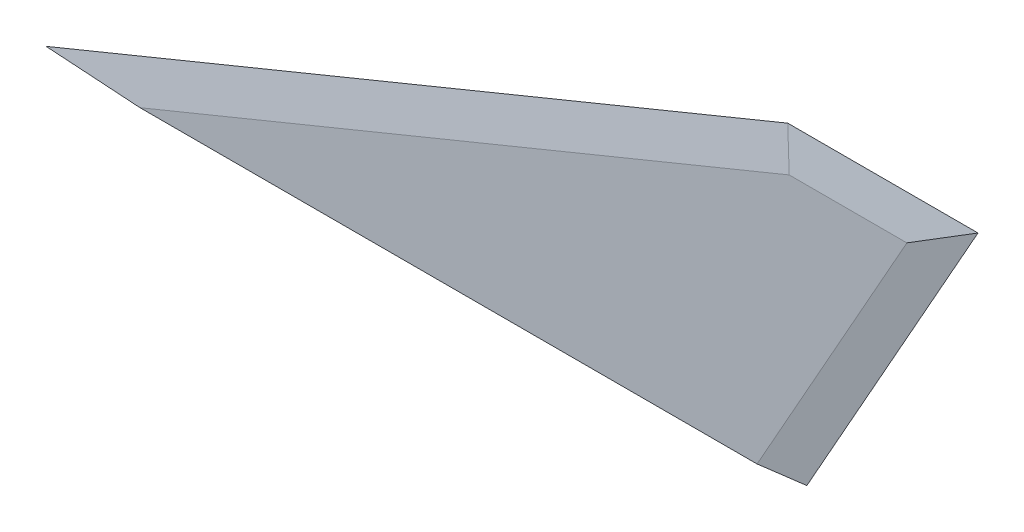
ISO-10303-21;
HEADER;
FILE_DESCRIPTION(('STEP AP214'),'2;1');
FILE_NAME('part.step','',(''),(''),'','','');
FILE_SCHEMA(('AUTOMOTIVE_DESIGN { 1 0 10303 214 1 1 1 1 }'));
ENDSEC;
DATA;
#1=APPLICATION_CONTEXT('core data for automotive mechanical design processes');
#2=APPLICATION_PROTOCOL_DEFINITION('international standard','automotive_design',2000,#1);
#3=PRODUCT_CONTEXT('',#1,'mechanical');
#4=PRODUCT('Part','Part','',(#3));
#5=PRODUCT_RELATED_PRODUCT_CATEGORY('part','',(#4));
#6=PRODUCT_DEFINITION_FORMATION('','',#4);
#7=PRODUCT_DEFINITION_CONTEXT('part definition',#1,'design');
#8=PRODUCT_DEFINITION('design','',#6,#7);
#9=PRODUCT_DEFINITION_SHAPE('','',#8);
#10=(LENGTH_UNIT() NAMED_UNIT(*) SI_UNIT(.MILLI.,.METRE.));
#11=(NAMED_UNIT(*) PLANE_ANGLE_UNIT() SI_UNIT($,.RADIAN.));
#12=(NAMED_UNIT(*) SI_UNIT($,.STERADIAN.) SOLID_ANGLE_UNIT());
#13=UNCERTAINTY_MEASURE_WITH_UNIT(LENGTH_MEASURE(1.E-05),#10,'distance_accuracy_value','');
#14=(GEOMETRIC_REPRESENTATION_CONTEXT(3) GLOBAL_UNCERTAINTY_ASSIGNED_CONTEXT((#13)) GLOBAL_UNIT_ASSIGNED_CONTEXT((#10,
#11,#12)) REPRESENTATION_CONTEXT('',''));
#15=CARTESIAN_POINT('',(0.,0.,0.));
#16=DIRECTION('',(0.,0.,1.));
#17=DIRECTION('',(1.,0.,0.));
#18=AXIS2_PLACEMENT_3D('',#15,#16,#17);
#19=CARTESIAN_POINT('',(143.221894277,-80.5522465000001,3.18));
#20=DIRECTION('',(-0.136865424260641,0.0769771789992358,-0.987594233253351));
#21=DIRECTION('',(0.490214690357422,0.871601719455496,0.));
#22=AXIS2_PLACEMENT_3D('',#19,#20,#21);
#23=PLANE('',#22);
#24=DIRECTION('',(0.490214690357422,0.871601719455496,0.));
#25=VECTOR('',#24,1.);
#26=CARTESIAN_POINT('',(143.221894277,-80.5522465000001,3.18));
#27=LINE('',#26,#25);
#28=CARTESIAN_POINT('',(188.526869811309,0.,3.18));
#29=VERTEX_POINT('',#28);
#30=CARTESIAN_POINT('',(227.902572848429,70.0099999999997,3.18));
#31=VERTEX_POINT('',#30);
#32=EDGE_CURVE('E125',#29,#31,#27,.T.);
#33=ORIENTED_EDGE('',*,*,#32,.F.);
#34=CARTESIAN_POINT('',(176.957728958506,-40.9691579117755,1.59));
#35=DIRECTION('',(-0.136865424260641,0.0769771789992358,-0.987594233253351));
#36=DIRECTION('',(-0.990589650481951,-0.010635598965719,0.136451560609198));
#37=AXIS2_PLACEMENT_3D('',#34,#35,#36);
#38=ELLIPSE('',#37,299.564336438406,41.);
#39=CARTESIAN_POINT('',(200.,0.0308420177488819,1.59240395441873));
#40=VERTEX_POINT('',#39);
#41=EDGE_CURVE('E119',#29,#40,#38,.T.);
#42=ORIENTED_EDGE('',*,*,#41,.T.);
#43=DIRECTION('',(0.,-0.996976127070232,-0.0777084426046488));
#44=VECTOR('',#43,1.);
#45=CARTESIAN_POINT('',(200.,-79.9426407341724,-4.64106004294312));
#46=LINE('',#45,#44);
#47=CARTESIAN_POINT('',(200.,0.,1.59));
#48=VERTEX_POINT('',#47);
#49=EDGE_CURVE('E107',#48,#40,#46,.F.);
#50=ORIENTED_EDGE('',*,*,#49,.F.);
#51=DIRECTION('',(-0.490214690357422,-0.871601719455496,0.));
#52=VECTOR('',#51,1.);
#53=CARTESIAN_POINT('',(200.,0.,1.58999999999999));
#54=LINE('',#53,#52);
#55=CARTESIAN_POINT('',(245.,80.01,1.58999999999999));
#56=VERTEX_POINT('',#55);
#57=EDGE_CURVE('E154',#56,#48,#54,.T.);
#58=ORIENTED_EDGE('',*,*,#57,.F.);
#59=DIRECTION('',(0.860428183681422,0.503250094914057,-0.0800167650913335));
#60=VECTOR('',#59,1.);
#61=CARTESIAN_POINT('',(59.1779434260307,-28.6742218578463,18.8707912753972));
#62=LINE('',#61,#60);
#63=EDGE_CURVE('E165',#56,#31,#62,.F.);
#64=ORIENTED_EDGE('',*,*,#63,.T.);
#65=EDGE_LOOP('',(#33,#42,#50,#58,#64));
#66=FACE_BOUND('',#65,.T.);
#67=ADVANCED_FACE('F47',(#66),#23,.F.);
#68=CARTESIAN_POINT('',(200.,0.,1.59));
#69=DIRECTION('',(0.136865424260642,-0.076977178999236,-0.987594233253351));
#70=DIRECTION('',(-0.490214690357422,-0.871601719455496,0.));
#71=AXIS2_PLACEMENT_3D('',#68,#69,#70);
#72=PLANE('',#71);
#73=DIRECTION('',(0.,-0.996976127070232,0.0777084426046489));
#74=VECTOR('',#73,1.);
#75=CARTESIAN_POINT('',(200.,0.,1.59));
#76=LINE('',#75,#74);
#77=CARTESIAN_POINT('',(200.,0.0308420882244587,1.5875960400881));
#78=VERTEX_POINT('',#77);
#79=EDGE_CURVE('E57',#78,#48,#76,.T.);
#80=ORIENTED_EDGE('',*,*,#79,.F.);
#81=CARTESIAN_POINT('',(176.957728958506,-40.9691579117755,1.59));
#82=DIRECTION('',(0.136865424260642,-0.076977178999236,-0.987594233253351));
#83=DIRECTION('',(-0.990589650481951,-0.010635598965719,-0.136451560609199));
#84=AXIS2_PLACEMENT_3D('',#81,#82,#83);
#85=ELLIPSE('',#84,299.564336438406,41.);
#86=CARTESIAN_POINT('',(188.526869811309,0.,0.));
#87=VERTEX_POINT('',#86);
#88=EDGE_CURVE('E11',#78,#87,#85,.F.);
#89=ORIENTED_EDGE('',*,*,#88,.T.);
#90=DIRECTION('',(-0.490214690357422,-0.871601719455496,0.));
#91=VECTOR('',#90,1.);
#92=CARTESIAN_POINT('',(191.283982805445,4.90214690357433,0.));
#93=LINE('',#92,#91);
#94=CARTESIAN_POINT('',(227.902572848429,70.0099999999998,0.));
#95=VERTEX_POINT('',#94);
#96=EDGE_CURVE('E175',#95,#87,#93,.T.);
#97=ORIENTED_EDGE('',*,*,#96,.F.);
#98=DIRECTION('',(-0.860428183681422,-0.503250094914057,-0.0800167650913336));
#99=VECTOR('',#98,1.);
#100=CARTESIAN_POINT('',(245.,80.01,1.59));
#101=LINE('',#100,#99);
#102=EDGE_CURVE('E127',#95,#56,#101,.F.);
#103=ORIENTED_EDGE('',*,*,#102,.T.);
#104=ORIENTED_EDGE('',*,*,#57,.T.);
#105=EDGE_LOOP('',(#80,#89,#97,#103,#104));
#106=FACE_BOUND('',#105,.T.);
#107=ADVANCED_FACE('F199',(#106),#72,.T.);
#108=CARTESIAN_POINT('',(0.,0.,3.18));
#109=DIRECTION('',(0.,0.,-1.));
#110=DIRECTION('',(-1.,0.,0.));
#111=AXIS2_PLACEMENT_3D('',#108,#109,#110);
#112=PLANE('',#111);
#113=DIRECTION('',(1.,0.,0.));
#114=VECTOR('',#113,1.);
#115=CARTESIAN_POINT('',(0.,0.,3.18));
#116=LINE('',#115,#114);
#117=CARTESIAN_POINT('',(26.3437301400065,0.,3.18));
#118=VERTEX_POINT('',#117);
#119=EDGE_CURVE('E138',#118,#29,#116,.T.);
#120=ORIENTED_EDGE('',*,*,#119,.T.);
#121=ORIENTED_EDGE('',*,*,#32,.T.);
#122=DIRECTION('',(-1.,0.,0.));
#123=VECTOR('',#122,1.);
#124=CARTESIAN_POINT('',(0.,70.0099999999998,3.18));
#125=LINE('',#124,#123);
#126=CARTESIAN_POINT('',(196.971776634194,70.0099999999997,3.18));
#127=VERTEX_POINT('',#126);
#128=EDGE_CURVE('E149',#31,#127,#125,.T.);
#129=ORIENTED_EDGE('',*,*,#128,.T.);
#130=DIRECTION('',(-0.925151957459522,-0.379596964699161,0.));
#131=VECTOR('',#130,1.);
#132=CARTESIAN_POINT('',(3.79596964699172,-9.25151957459548,3.18));
#133=LINE('',#132,#131);
#134=EDGE_CURVE('E141',#127,#118,#133,.T.);
#135=ORIENTED_EDGE('',*,*,#134,.T.);
#136=EDGE_LOOP('',(#120,#121,#129,#135));
#137=FACE_BOUND('',#136,.T.);
#138=ADVANCED_FACE('F204',(#137),#112,.F.);
#139=CARTESIAN_POINT('',(0.,0.,0.));
#140=DIRECTION('',(0.,0.,-1.));
#141=DIRECTION('',(-1.,0.,0.));
#142=AXIS2_PLACEMENT_3D('',#139,#140,#141);
#143=PLANE('',#142);
#144=DIRECTION('',(1.,0.,0.));
#145=VECTOR('',#144,1.);
#146=CARTESIAN_POINT('',(245.,70.0099999999998,0.));
#147=LINE('',#146,#145);
#148=CARTESIAN_POINT('',(196.971776634194,70.0099999999998,0.));
#149=VERTEX_POINT('',#148);
#150=EDGE_CURVE('E72',#149,#95,#147,.T.);
#151=ORIENTED_EDGE('',*,*,#150,.T.);
#152=ORIENTED_EDGE('',*,*,#96,.T.);
#153=DIRECTION('',(1.,0.,0.));
#154=VECTOR('',#153,1.);
#155=CARTESIAN_POINT('',(0.,0.,0.));
#156=LINE('',#155,#154);
#157=CARTESIAN_POINT('',(26.3437301400064,0.,0.));
#158=VERTEX_POINT('',#157);
#159=EDGE_CURVE('E142',#158,#87,#156,.T.);
#160=ORIENTED_EDGE('',*,*,#159,.F.);
#161=DIRECTION('',(0.925151957459522,0.379596964699161,0.));
#162=VECTOR('',#161,1.);
#163=CARTESIAN_POINT('',(198.795969646992,70.7584804254046,0.));
#164=LINE('',#163,#162);
#165=EDGE_CURVE('E164',#158,#149,#164,.T.);
#166=ORIENTED_EDGE('',*,*,#165,.T.);
#167=EDGE_LOOP('',(#151,#152,#160,#166));
#168=FACE_BOUND('',#167,.T.);
#169=ADVANCED_FACE('F201',(#168),#143,.T.);
#170=CARTESIAN_POINT('',(3.79596964699172,-9.25151957459548,3.18));
#171=DIRECTION('',(0.0596071559542799,-0.145274283353138,-0.987594233253351));
#172=DIRECTION('',(-0.925151957459522,-0.379596964699161,0.));
#173=AXIS2_PLACEMENT_3D('',#170,#171,#172);
#174=PLANE('',#173);
#175=DIRECTION('',(0.925151957459522,0.379596964699161,0.));
#176=VECTOR('',#175,1.);
#177=CARTESIAN_POINT('',(195.,80.01,1.58999999999999));
#178=LINE('',#177,#176);
#179=CARTESIAN_POINT('',(0.0751681940228399,0.0308420882244448,1.58999999999999));
#180=VERTEX_POINT('',#179);
#181=CARTESIAN_POINT('',(195.,80.01,1.58999999999999));
#182=VERTEX_POINT('',#181);
#183=EDGE_CURVE('E161',#180,#182,#178,.T.);
#184=ORIENTED_EDGE('',*,*,#183,.F.);
#185=CARTESIAN_POINT('',(-99.8498411798052,-40.9691579117755,1.59));
#186=DIRECTION('',(0.0596071559542799,-0.145274283353138,-0.987594233253351));
#187=DIRECTION('',(-0.998221912682266,-0.00867481143617515,-0.0589725418097665));
#188=AXIS2_PLACEMENT_3D('',#185,#186,#187);
#189=ELLIPSE('',#188,687.836877026106,41.);
#190=EDGE_CURVE('E128',#180,#118,#189,.T.);
#191=ORIENTED_EDGE('',*,*,#190,.T.);
#192=ORIENTED_EDGE('',*,*,#134,.F.);
#193=DIRECTION('',(-0.191141171869779,0.96938552042382,-0.154132297747384));
#194=VECTOR('',#193,1.);
#195=CARTESIAN_POINT('',(204.600434743621,31.3207388680203,9.33159251998461));
#196=LINE('',#195,#194);
#197=EDGE_CURVE('E145',#182,#127,#196,.F.);
#198=ORIENTED_EDGE('',*,*,#197,.F.);
#199=EDGE_LOOP('',(#184,#191,#192,#198));
#200=FACE_BOUND('',#199,.T.);
#201=ADVANCED_FACE('F193',(#200),#174,.F.);
#202=CARTESIAN_POINT('',(0.,70.0099999999998,3.18));
#203=DIRECTION('',(0.,-0.15702748308728,-0.987594233253351));
#204=DIRECTION('',(-1.,0.,0.));
#205=AXIS2_PLACEMENT_3D('',#202,#203,#204);
#206=PLANE('',#205);
#207=ORIENTED_EDGE('',*,*,#197,.T.);
#208=ORIENTED_EDGE('',*,*,#128,.F.);
#209=ORIENTED_EDGE('',*,*,#63,.F.);
#210=DIRECTION('',(1.,0.,0.));
#211=VECTOR('',#210,1.);
#212=CARTESIAN_POINT('',(245.,80.01,1.58999999999999));
#213=LINE('',#212,#211);
#214=EDGE_CURVE('E157',#182,#56,#213,.T.);
#215=ORIENTED_EDGE('',*,*,#214,.F.);
#216=EDGE_LOOP('',(#207,#208,#209,#215));
#217=FACE_BOUND('',#216,.T.);
#218=ADVANCED_FACE('F197',(#217),#206,.F.);
#219=CARTESIAN_POINT('',(195.,80.01,1.59));
#220=DIRECTION('',(-0.0596071559542802,0.145274283353139,-0.987594233253351));
#221=DIRECTION('',(0.925151957459522,0.379596964699161,0.));
#222=AXIS2_PLACEMENT_3D('',#219,#220,#221);
#223=PLANE('',#222);
#224=ORIENTED_EDGE('',*,*,#165,.F.);
#225=CARTESIAN_POINT('',(-99.8498411798053,-40.9691579117755,1.59));
#226=DIRECTION('',(-0.0596071559542802,0.145274283353139,-0.987594233253351));
#227=DIRECTION('',(-0.998221912682266,-0.00867481143617522,0.0589725418097667));
#228=AXIS2_PLACEMENT_3D('',#225,#226,#227);
#229=ELLIPSE('',#228,687.836877026104,41.);
#230=EDGE_CURVE('E115',#158,#180,#229,.F.);
#231=ORIENTED_EDGE('',*,*,#230,.T.);
#232=ORIENTED_EDGE('',*,*,#183,.T.);
#233=DIRECTION('',(0.191141171869772,-0.969385520423821,-0.154132297747385));
#234=VECTOR('',#233,1.);
#235=CARTESIAN_POINT('',(195.,80.01,1.59));
#236=LINE('',#235,#234);
#237=EDGE_CURVE('E132',#149,#182,#236,.F.);
#238=ORIENTED_EDGE('',*,*,#237,.F.);
#239=EDGE_LOOP('',(#224,#231,#232,#238));
#240=FACE_BOUND('',#239,.T.);
#241=ADVANCED_FACE('F50',(#240),#223,.T.);
#242=CARTESIAN_POINT('',(245.,80.01,1.59));
#243=DIRECTION('',(0.,0.15702748308728,-0.987594233253351));
#244=DIRECTION('',(1.,0.,0.));
#245=AXIS2_PLACEMENT_3D('',#242,#243,#244);
#246=PLANE('',#245);
#247=ORIENTED_EDGE('',*,*,#237,.T.);
#248=ORIENTED_EDGE('',*,*,#214,.T.);
#249=ORIENTED_EDGE('',*,*,#102,.F.);
#250=ORIENTED_EDGE('',*,*,#150,.F.);
#251=EDGE_LOOP('',(#247,#248,#249,#250));
#252=FACE_BOUND('',#251,.T.);
#253=ADVANCED_FACE('F183',(#252),#246,.T.);
#254=CARTESIAN_POINT('',(200.,-40.9691579117755,1.59));
#255=DIRECTION('',(-1.,0.,0.));
#256=DIRECTION('',(0.,0.,1.));
#257=AXIS2_PLACEMENT_3D('',#254,#255,#256);
#258=CYLINDRICAL_SURFACE('',#257,41.);
#259=ORIENTED_EDGE('',*,*,#119,.F.);
#260=ORIENTED_EDGE('',*,*,#190,.F.);
#261=ORIENTED_EDGE('',*,*,#230,.F.);
#262=ORIENTED_EDGE('',*,*,#159,.T.);
#263=ORIENTED_EDGE('',*,*,#88,.F.);
#264=CARTESIAN_POINT('',(200.,-40.9691579117755,1.59));
#265=DIRECTION('',(1.,0.,0.));
#266=DIRECTION('',(0.,0.,-1.));
#267=AXIS2_PLACEMENT_3D('',#264,#265,#266);
#268=CIRCLE('',#267,41.);
#269=EDGE_CURVE('E64',#78,#40,#268,.T.);
#270=ORIENTED_EDGE('',*,*,#269,.T.);
#271=ORIENTED_EDGE('',*,*,#41,.F.);
#272=EDGE_LOOP('',(#259,#260,#261,#262,#263,#270,#271));
#273=FACE_BOUND('',#272,.T.);
#274=ADVANCED_FACE('F118',(#273),#258,.F.);
#275=CARTESIAN_POINT('',(200.,-40.9691579117755,1.59));
#276=DIRECTION('',(1.,0.,0.));
#277=DIRECTION('',(0.,0.,-1.));
#278=AXIS2_PLACEMENT_3D('',#275,#276,#277);
#279=PLANE('',#278);
#280=ORIENTED_EDGE('',*,*,#49,.T.);
#281=ORIENTED_EDGE('',*,*,#269,.F.);
#282=ORIENTED_EDGE('',*,*,#79,.T.);
#283=EDGE_LOOP('',(#280,#281,#282));
#284=FACE_BOUND('',#283,.T.);
#285=ADVANCED_FACE('F108',(#284),#279,.F.);
#286=CLOSED_SHELL('',(#67,#107,#138,#169,#201,#218,#241,#253,#274,#285));
#287=MANIFOLD_SOLID_BREP('B2',#286);
#288=ADVANCED_BREP_SHAPE_REPRESENTATION('',(#18,#287),#14);
#289=SHAPE_DEFINITION_REPRESENTATION(#9,#288);
ENDSEC;
END-ISO-10303-21;
